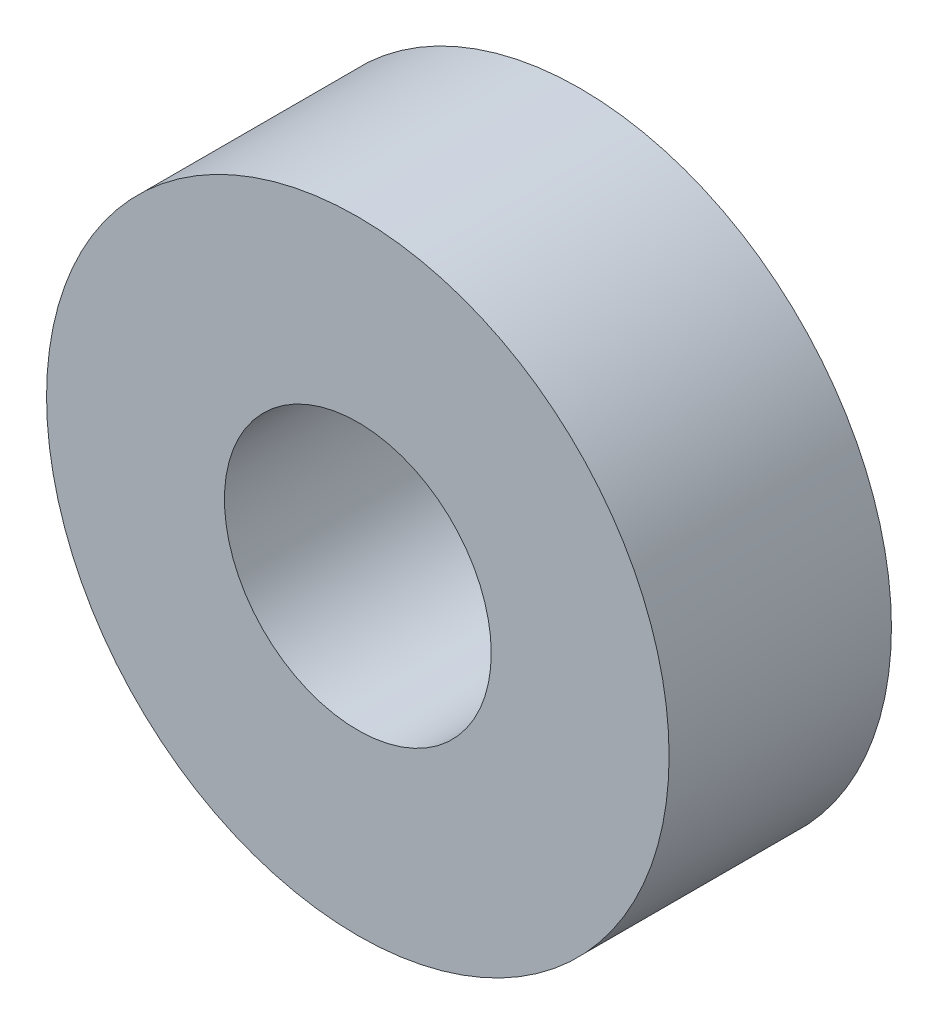
ISO-10303-21;
HEADER;
FILE_DESCRIPTION(('STEP AP214'),'2;1');
FILE_NAME('part.step','',(''),(''),'','','');
FILE_SCHEMA(('AUTOMOTIVE_DESIGN { 1 0 10303 214 1 1 1 1 }'));
ENDSEC;
DATA;
#1=APPLICATION_CONTEXT('core data for automotive mechanical design processes');
#2=APPLICATION_PROTOCOL_DEFINITION('international standard','automotive_design',2000,#1);
#3=PRODUCT_CONTEXT('',#1,'mechanical');
#4=PRODUCT('Part','Part','',(#3));
#5=PRODUCT_RELATED_PRODUCT_CATEGORY('part','',(#4));
#6=PRODUCT_DEFINITION_FORMATION('','',#4);
#7=PRODUCT_DEFINITION_CONTEXT('part definition',#1,'design');
#8=PRODUCT_DEFINITION('design','',#6,#7);
#9=PRODUCT_DEFINITION_SHAPE('','',#8);
#10=(LENGTH_UNIT() NAMED_UNIT(*) SI_UNIT(.MILLI.,.METRE.));
#11=(NAMED_UNIT(*) PLANE_ANGLE_UNIT() SI_UNIT($,.RADIAN.));
#12=(NAMED_UNIT(*) SI_UNIT($,.STERADIAN.) SOLID_ANGLE_UNIT());
#13=UNCERTAINTY_MEASURE_WITH_UNIT(LENGTH_MEASURE(1.E-05),#10,'distance_accuracy_value','');
#14=(GEOMETRIC_REPRESENTATION_CONTEXT(3) GLOBAL_UNCERTAINTY_ASSIGNED_CONTEXT((#13)) GLOBAL_UNIT_ASSIGNED_CONTEXT((#10,
#11,#12)) REPRESENTATION_CONTEXT('',''));
#15=CARTESIAN_POINT('',(0.,0.,0.));
#16=DIRECTION('',(0.,0.,1.));
#17=DIRECTION('',(1.,0.,0.));
#18=AXIS2_PLACEMENT_3D('',#15,#16,#17);
#19=CARTESIAN_POINT('',(0.,0.,2.5));
#20=DIRECTION('',(0.,0.,1.));
#21=DIRECTION('',(1.,0.,0.));
#22=AXIS2_PLACEMENT_3D('',#19,#20,#21);
#23=PLANE('',#22);
#24=CARTESIAN_POINT('',(0.,0.,2.5));
#25=DIRECTION('',(0.,0.,1.));
#26=DIRECTION('',(1.,0.,0.));
#27=AXIS2_PLACEMENT_3D('',#24,#25,#26);
#28=CIRCLE('',#27,7.);
#29=CARTESIAN_POINT('',(7.,0.,2.5));
#30=VERTEX_POINT('',#29);
#31=EDGE_CURVE('E10',#30,#30,#28,.T.);
#32=ORIENTED_EDGE('',*,*,#31,.T.);
#33=EDGE_LOOP('',(#32));
#34=FACE_BOUND('',#33,.T.);
#35=CARTESIAN_POINT('',(0.,0.,2.5));
#36=DIRECTION('',(0.,0.,1.));
#37=DIRECTION('',(1.,0.,0.));
#38=AXIS2_PLACEMENT_3D('',#35,#36,#37);
#39=CIRCLE('',#38,3.);
#40=CARTESIAN_POINT('',(3.,0.,2.5));
#41=VERTEX_POINT('',#40);
#42=EDGE_CURVE('E41',#41,#41,#39,.T.);
#43=ORIENTED_EDGE('',*,*,#42,.F.);
#44=EDGE_LOOP('',(#43));
#45=FACE_BOUND('',#44,.T.);
#46=ADVANCED_FACE('F30',(#34,#45),#23,.T.);
#47=CARTESIAN_POINT('',(0.,0.,-2.5));
#48=DIRECTION('',(0.,0.,1.));
#49=DIRECTION('',(1.,0.,0.));
#50=AXIS2_PLACEMENT_3D('',#47,#48,#49);
#51=PLANE('',#50);
#52=CARTESIAN_POINT('',(0.,0.,-2.5));
#53=DIRECTION('',(0.,0.,1.));
#54=DIRECTION('',(1.,0.,0.));
#55=AXIS2_PLACEMENT_3D('',#52,#53,#54);
#56=CIRCLE('',#55,7.);
#57=CARTESIAN_POINT('',(7.,0.,-2.5));
#58=VERTEX_POINT('',#57);
#59=EDGE_CURVE('E34',#58,#58,#56,.T.);
#60=ORIENTED_EDGE('',*,*,#59,.F.);
#61=EDGE_LOOP('',(#60));
#62=FACE_BOUND('',#61,.T.);
#63=CARTESIAN_POINT('',(0.,0.,-2.5));
#64=DIRECTION('',(0.,0.,1.));
#65=DIRECTION('',(1.,0.,0.));
#66=AXIS2_PLACEMENT_3D('',#63,#64,#65);
#67=CIRCLE('',#66,3.);
#68=CARTESIAN_POINT('',(3.,0.,-2.5));
#69=VERTEX_POINT('',#68);
#70=EDGE_CURVE('E43',#69,#69,#67,.T.);
#71=ORIENTED_EDGE('',*,*,#70,.T.);
#72=EDGE_LOOP('',(#71));
#73=FACE_BOUND('',#72,.T.);
#74=ADVANCED_FACE('F53',(#62,#73),#51,.F.);
#75=CARTESIAN_POINT('',(0.,0.,2.5));
#76=DIRECTION('',(0.,0.,-1.));
#77=DIRECTION('',(-1.,0.,0.));
#78=AXIS2_PLACEMENT_3D('',#75,#76,#77);
#79=CYLINDRICAL_SURFACE('',#78,7.);
#80=ORIENTED_EDGE('',*,*,#31,.F.);
#81=EDGE_LOOP('',(#80));
#82=FACE_BOUND('',#81,.T.);
#83=ORIENTED_EDGE('',*,*,#59,.T.);
#84=EDGE_LOOP('',(#83));
#85=FACE_BOUND('',#84,.T.);
#86=ADVANCED_FACE('F32',(#82,#85),#79,.T.);
#87=CARTESIAN_POINT('',(0.,0.,2.5));
#88=DIRECTION('',(0.,0.,-1.));
#89=DIRECTION('',(-1.,0.,0.));
#90=AXIS2_PLACEMENT_3D('',#87,#88,#89);
#91=CYLINDRICAL_SURFACE('',#90,3.);
#92=ORIENTED_EDGE('',*,*,#42,.T.);
#93=EDGE_LOOP('',(#92));
#94=FACE_BOUND('',#93,.T.);
#95=ORIENTED_EDGE('',*,*,#70,.F.);
#96=EDGE_LOOP('',(#95));
#97=FACE_BOUND('',#96,.T.);
#98=ADVANCED_FACE('F49',(#94,#97),#91,.F.);
#99=CLOSED_SHELL('',(#46,#74,#86,#98));
#100=MANIFOLD_SOLID_BREP('B2',#99);
#101=ADVANCED_BREP_SHAPE_REPRESENTATION('',(#18,#100),#14);
#102=SHAPE_DEFINITION_REPRESENTATION(#9,#101);
ENDSEC;
END-ISO-10303-21;
